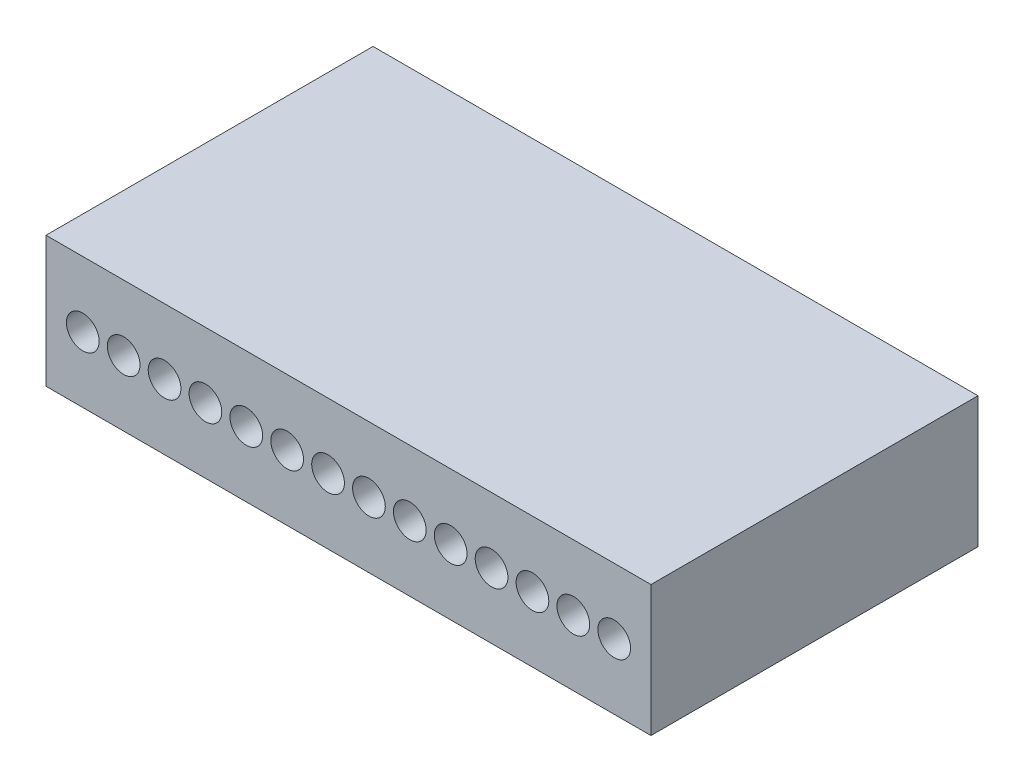
ISO-10303-21;
HEADER;
FILE_DESCRIPTION(('STEP AP214'),'2;1');
FILE_NAME('part.step','',(''),(''),'','','');
FILE_SCHEMA(('AUTOMOTIVE_DESIGN { 1 0 10303 214 1 1 1 1 }'));
ENDSEC;
DATA;
#1=APPLICATION_CONTEXT('core data for automotive mechanical design processes');
#2=APPLICATION_PROTOCOL_DEFINITION('international standard','automotive_design',2000,#1);
#3=PRODUCT_CONTEXT('',#1,'mechanical');
#4=PRODUCT('Part','Part','',(#3));
#5=PRODUCT_RELATED_PRODUCT_CATEGORY('part','',(#4));
#6=PRODUCT_DEFINITION_FORMATION('','',#4);
#7=PRODUCT_DEFINITION_CONTEXT('part definition',#1,'design');
#8=PRODUCT_DEFINITION('design','',#6,#7);
#9=PRODUCT_DEFINITION_SHAPE('','',#8);
#10=(LENGTH_UNIT() NAMED_UNIT(*) SI_UNIT(.MILLI.,.METRE.));
#11=(NAMED_UNIT(*) PLANE_ANGLE_UNIT() SI_UNIT($,.RADIAN.));
#12=(NAMED_UNIT(*) SI_UNIT($,.STERADIAN.) SOLID_ANGLE_UNIT());
#13=UNCERTAINTY_MEASURE_WITH_UNIT(LENGTH_MEASURE(1.E-05),#10,'distance_accuracy_value','');
#14=(GEOMETRIC_REPRESENTATION_CONTEXT(3) GLOBAL_UNCERTAINTY_ASSIGNED_CONTEXT((#13)) GLOBAL_UNIT_ASSIGNED_CONTEXT((#10,
#11,#12)) REPRESENTATION_CONTEXT('',''));
#15=CARTESIAN_POINT('',(0.,0.,0.));
#16=DIRECTION('',(0.,0.,1.));
#17=DIRECTION('',(1.,0.,0.));
#18=AXIS2_PLACEMENT_3D('',#15,#16,#17);
#19=CARTESIAN_POINT('',(0.,0.,10.));
#20=DIRECTION('',(1.,0.,0.));
#21=DIRECTION('',(0.,0.,-1.));
#22=AXIS2_PLACEMENT_3D('',#19,#20,#21);
#23=PLANE('',#22);
#24=DIRECTION('',(0.,-1.,0.));
#25=VECTOR('',#24,1.);
#26=CARTESIAN_POINT('',(0.,0.,0.));
#27=LINE('',#26,#25);
#28=CARTESIAN_POINT('',(0.,4.,0.));
#29=VERTEX_POINT('',#28);
#30=CARTESIAN_POINT('',(0.,0.,0.));
#31=VERTEX_POINT('',#30);
#32=EDGE_CURVE('E99',#29,#31,#27,.T.);
#33=ORIENTED_EDGE('',*,*,#32,.T.);
#34=DIRECTION('',(0.,0.,-1.));
#35=VECTOR('',#34,1.);
#36=CARTESIAN_POINT('',(0.,0.,10.));
#37=LINE('',#36,#35);
#38=CARTESIAN_POINT('',(0.,0.,10.));
#39=VERTEX_POINT('',#38);
#40=EDGE_CURVE('E11',#39,#31,#37,.T.);
#41=ORIENTED_EDGE('',*,*,#40,.F.);
#42=DIRECTION('',(0.,-1.,0.));
#43=VECTOR('',#42,1.);
#44=CARTESIAN_POINT('',(0.,0.,10.));
#45=LINE('',#44,#43);
#46=CARTESIAN_POINT('',(0.,4.,10.));
#47=VERTEX_POINT('',#46);
#48=EDGE_CURVE('E87',#47,#39,#45,.T.);
#49=ORIENTED_EDGE('',*,*,#48,.F.);
#50=DIRECTION('',(0.,0.,-1.));
#51=VECTOR('',#50,1.);
#52=CARTESIAN_POINT('',(0.,4.,10.));
#53=LINE('',#52,#51);
#54=EDGE_CURVE('E95',#47,#29,#53,.T.);
#55=ORIENTED_EDGE('',*,*,#54,.T.);
#56=EDGE_LOOP('',(#33,#41,#49,#55));
#57=FACE_BOUND('',#56,.T.);
#58=ADVANCED_FACE('F36',(#57),#23,.F.);
#59=CARTESIAN_POINT('',(0.,0.,10.));
#60=DIRECTION('',(0.,1.,0.));
#61=DIRECTION('',(0.,0.,1.));
#62=AXIS2_PLACEMENT_3D('',#59,#60,#61);
#63=PLANE('',#62);
#64=DIRECTION('',(1.,0.,0.));
#65=VECTOR('',#64,1.);
#66=CARTESIAN_POINT('',(0.,0.,0.));
#67=LINE('',#66,#65);
#68=CARTESIAN_POINT('',(18.5,0.,0.));
#69=VERTEX_POINT('',#68);
#70=EDGE_CURVE('E91',#31,#69,#67,.T.);
#71=ORIENTED_EDGE('',*,*,#70,.T.);
#72=DIRECTION('',(0.,0.,-1.));
#73=VECTOR('',#72,1.);
#74=CARTESIAN_POINT('',(18.5,0.,10.));
#75=LINE('',#74,#73);
#76=CARTESIAN_POINT('',(18.5,0.,10.));
#77=VERTEX_POINT('',#76);
#78=EDGE_CURVE('E44',#77,#69,#75,.T.);
#79=ORIENTED_EDGE('',*,*,#78,.F.);
#80=DIRECTION('',(1.,0.,0.));
#81=VECTOR('',#80,1.);
#82=CARTESIAN_POINT('',(0.,0.,10.));
#83=LINE('',#82,#81);
#84=EDGE_CURVE('E82',#39,#77,#83,.T.);
#85=ORIENTED_EDGE('',*,*,#84,.F.);
#86=ORIENTED_EDGE('',*,*,#40,.T.);
#87=EDGE_LOOP('',(#71,#79,#85,#86));
#88=FACE_BOUND('',#87,.T.);
#89=ADVANCED_FACE('F90',(#88),#63,.F.);
#90=CARTESIAN_POINT('',(18.5,0.,10.));
#91=DIRECTION('',(-1.,0.,0.));
#92=DIRECTION('',(0.,0.,1.));
#93=AXIS2_PLACEMENT_3D('',#90,#91,#92);
#94=PLANE('',#93);
#95=DIRECTION('',(0.,1.,0.));
#96=VECTOR('',#95,1.);
#97=CARTESIAN_POINT('',(18.5,0.,0.));
#98=LINE('',#97,#96);
#99=CARTESIAN_POINT('',(18.5,4.,0.));
#100=VERTEX_POINT('',#99);
#101=EDGE_CURVE('E69',#69,#100,#98,.T.);
#102=ORIENTED_EDGE('',*,*,#101,.T.);
#103=DIRECTION('',(0.,0.,-1.));
#104=VECTOR('',#103,1.);
#105=CARTESIAN_POINT('',(18.5,4.,10.));
#106=LINE('',#105,#104);
#107=CARTESIAN_POINT('',(18.5,4.,10.));
#108=VERTEX_POINT('',#107);
#109=EDGE_CURVE('E92',#108,#100,#106,.T.);
#110=ORIENTED_EDGE('',*,*,#109,.F.);
#111=DIRECTION('',(0.,1.,0.));
#112=VECTOR('',#111,1.);
#113=CARTESIAN_POINT('',(18.5,0.,10.));
#114=LINE('',#113,#112);
#115=EDGE_CURVE('E85',#77,#108,#114,.T.);
#116=ORIENTED_EDGE('',*,*,#115,.F.);
#117=ORIENTED_EDGE('',*,*,#78,.T.);
#118=EDGE_LOOP('',(#102,#110,#116,#117));
#119=FACE_BOUND('',#118,.T.);
#120=ADVANCED_FACE('F93',(#119),#94,.F.);
#121=CARTESIAN_POINT('',(0.,4.,10.));
#122=DIRECTION('',(0.,-1.,0.));
#123=DIRECTION('',(0.,0.,-1.));
#124=AXIS2_PLACEMENT_3D('',#121,#122,#123);
#125=PLANE('',#124);
#126=DIRECTION('',(-1.,0.,0.));
#127=VECTOR('',#126,1.);
#128=CARTESIAN_POINT('',(0.,4.,0.));
#129=LINE('',#128,#127);
#130=EDGE_CURVE('E75',#100,#29,#129,.T.);
#131=ORIENTED_EDGE('',*,*,#130,.T.);
#132=ORIENTED_EDGE('',*,*,#54,.F.);
#133=DIRECTION('',(-1.,0.,0.));
#134=VECTOR('',#133,1.);
#135=CARTESIAN_POINT('',(0.,4.,10.));
#136=LINE('',#135,#134);
#137=EDGE_CURVE('E52',#108,#47,#136,.T.);
#138=ORIENTED_EDGE('',*,*,#137,.F.);
#139=ORIENTED_EDGE('',*,*,#109,.T.);
#140=EDGE_LOOP('',(#131,#132,#138,#139));
#141=FACE_BOUND('',#140,.T.);
#142=ADVANCED_FACE('F107',(#141),#125,.F.);
#143=CARTESIAN_POINT('',(0.,0.,10.));
#144=DIRECTION('',(0.,0.,-1.));
#145=DIRECTION('',(-1.,0.,0.));
#146=AXIS2_PLACEMENT_3D('',#143,#144,#145);
#147=PLANE('',#146);
#148=CARTESIAN_POINT('',(1.125,2.,10.));
#149=DIRECTION('',(0.,0.,1.));
#150=DIRECTION('',(1.,0.,0.));
#151=AXIS2_PLACEMENT_3D('',#148,#149,#150);
#152=CIRCLE('',#151,0.5);
#153=CARTESIAN_POINT('',(1.625,2.,10.));
#154=VERTEX_POINT('',#153);
#155=EDGE_CURVE('E191',#154,#154,#152,.T.);
#156=ORIENTED_EDGE('',*,*,#155,.F.);
#157=EDGE_LOOP('',(#156));
#158=FACE_BOUND('',#157,.T.);
#159=CARTESIAN_POINT('',(2.375,2.,10.));
#160=DIRECTION('',(0.,0.,1.));
#161=DIRECTION('',(1.,0.,0.));
#162=AXIS2_PLACEMENT_3D('',#159,#160,#161);
#163=CIRCLE('',#162,0.5);
#164=CARTESIAN_POINT('',(2.875,2.,10.));
#165=VERTEX_POINT('',#164);
#166=EDGE_CURVE('E185',#165,#165,#163,.T.);
#167=ORIENTED_EDGE('',*,*,#166,.F.);
#168=EDGE_LOOP('',(#167));
#169=FACE_BOUND('',#168,.T.);
#170=CARTESIAN_POINT('',(3.625,2.,10.));
#171=DIRECTION('',(0.,0.,1.));
#172=DIRECTION('',(1.,0.,0.));
#173=AXIS2_PLACEMENT_3D('',#170,#171,#172);
#174=CIRCLE('',#173,0.5);
#175=CARTESIAN_POINT('',(4.125,2.,10.));
#176=VERTEX_POINT('',#175);
#177=EDGE_CURVE('E179',#176,#176,#174,.T.);
#178=ORIENTED_EDGE('',*,*,#177,.F.);
#179=EDGE_LOOP('',(#178));
#180=FACE_BOUND('',#179,.T.);
#181=CARTESIAN_POINT('',(4.875,2.,10.));
#182=DIRECTION('',(0.,0.,1.));
#183=DIRECTION('',(1.,0.,0.));
#184=AXIS2_PLACEMENT_3D('',#181,#182,#183);
#185=CIRCLE('',#184,0.5);
#186=CARTESIAN_POINT('',(5.375,2.,10.));
#187=VERTEX_POINT('',#186);
#188=EDGE_CURVE('E173',#187,#187,#185,.T.);
#189=ORIENTED_EDGE('',*,*,#188,.F.);
#190=EDGE_LOOP('',(#189));
#191=FACE_BOUND('',#190,.T.);
#192=CARTESIAN_POINT('',(6.125,2.,10.));
#193=DIRECTION('',(0.,0.,1.));
#194=DIRECTION('',(1.,0.,0.));
#195=AXIS2_PLACEMENT_3D('',#192,#193,#194);
#196=CIRCLE('',#195,0.5);
#197=CARTESIAN_POINT('',(6.625,2.,10.));
#198=VERTEX_POINT('',#197);
#199=EDGE_CURVE('E167',#198,#198,#196,.T.);
#200=ORIENTED_EDGE('',*,*,#199,.F.);
#201=EDGE_LOOP('',(#200));
#202=FACE_BOUND('',#201,.T.);
#203=CARTESIAN_POINT('',(7.375,2.,10.));
#204=DIRECTION('',(0.,0.,1.));
#205=DIRECTION('',(1.,0.,0.));
#206=AXIS2_PLACEMENT_3D('',#203,#204,#205);
#207=CIRCLE('',#206,0.500000000000002);
#208=CARTESIAN_POINT('',(7.875,2.,10.));
#209=VERTEX_POINT('',#208);
#210=EDGE_CURVE('E161',#209,#209,#207,.T.);
#211=ORIENTED_EDGE('',*,*,#210,.F.);
#212=EDGE_LOOP('',(#211));
#213=FACE_BOUND('',#212,.T.);
#214=CARTESIAN_POINT('',(8.625,2.,10.));
#215=DIRECTION('',(0.,0.,1.));
#216=DIRECTION('',(1.,0.,0.));
#217=AXIS2_PLACEMENT_3D('',#214,#215,#216);
#218=CIRCLE('',#217,0.499999999999999);
#219=CARTESIAN_POINT('',(9.125,2.,10.));
#220=VERTEX_POINT('',#219);
#221=EDGE_CURVE('E155',#220,#220,#218,.T.);
#222=ORIENTED_EDGE('',*,*,#221,.F.);
#223=EDGE_LOOP('',(#222));
#224=FACE_BOUND('',#223,.T.);
#225=CARTESIAN_POINT('',(9.875,2.,10.));
#226=DIRECTION('',(0.,0.,1.));
#227=DIRECTION('',(1.,0.,0.));
#228=AXIS2_PLACEMENT_3D('',#225,#226,#227);
#229=CIRCLE('',#228,0.499999999999999);
#230=CARTESIAN_POINT('',(10.375,2.,10.));
#231=VERTEX_POINT('',#230);
#232=EDGE_CURVE('E149',#231,#231,#229,.T.);
#233=ORIENTED_EDGE('',*,*,#232,.F.);
#234=EDGE_LOOP('',(#233));
#235=FACE_BOUND('',#234,.T.);
#236=CARTESIAN_POINT('',(11.125,2.,10.));
#237=DIRECTION('',(0.,0.,1.));
#238=DIRECTION('',(1.,0.,0.));
#239=AXIS2_PLACEMENT_3D('',#236,#237,#238);
#240=CIRCLE('',#239,0.499999999999999);
#241=CARTESIAN_POINT('',(11.625,2.,10.));
#242=VERTEX_POINT('',#241);
#243=EDGE_CURVE('E143',#242,#242,#240,.T.);
#244=ORIENTED_EDGE('',*,*,#243,.F.);
#245=EDGE_LOOP('',(#244));
#246=FACE_BOUND('',#245,.T.);
#247=CARTESIAN_POINT('',(12.375,2.,10.));
#248=DIRECTION('',(0.,0.,1.));
#249=DIRECTION('',(1.,0.,0.));
#250=AXIS2_PLACEMENT_3D('',#247,#248,#249);
#251=CIRCLE('',#250,0.499999999999999);
#252=CARTESIAN_POINT('',(12.875,2.,10.));
#253=VERTEX_POINT('',#252);
#254=EDGE_CURVE('E137',#253,#253,#251,.T.);
#255=ORIENTED_EDGE('',*,*,#254,.F.);
#256=EDGE_LOOP('',(#255));
#257=FACE_BOUND('',#256,.T.);
#258=CARTESIAN_POINT('',(13.625,2.,10.));
#259=DIRECTION('',(0.,0.,1.));
#260=DIRECTION('',(1.,0.,0.));
#261=AXIS2_PLACEMENT_3D('',#258,#259,#260);
#262=CIRCLE('',#261,0.499999999999999);
#263=CARTESIAN_POINT('',(14.125,2.,10.));
#264=VERTEX_POINT('',#263);
#265=EDGE_CURVE('E131',#264,#264,#262,.T.);
#266=ORIENTED_EDGE('',*,*,#265,.F.);
#267=EDGE_LOOP('',(#266));
#268=FACE_BOUND('',#267,.T.);
#269=CARTESIAN_POINT('',(14.875,2.,10.));
#270=DIRECTION('',(0.,0.,1.));
#271=DIRECTION('',(1.,0.,0.));
#272=AXIS2_PLACEMENT_3D('',#269,#270,#271);
#273=CIRCLE('',#272,0.499999999999999);
#274=CARTESIAN_POINT('',(15.375,2.,10.));
#275=VERTEX_POINT('',#274);
#276=EDGE_CURVE('E125',#275,#275,#273,.T.);
#277=ORIENTED_EDGE('',*,*,#276,.F.);
#278=EDGE_LOOP('',(#277));
#279=FACE_BOUND('',#278,.T.);
#280=CARTESIAN_POINT('',(16.125,2.,10.));
#281=DIRECTION('',(0.,0.,1.));
#282=DIRECTION('',(1.,0.,0.));
#283=AXIS2_PLACEMENT_3D('',#280,#281,#282);
#284=CIRCLE('',#283,0.499999999999999);
#285=CARTESIAN_POINT('',(16.625,2.,10.));
#286=VERTEX_POINT('',#285);
#287=EDGE_CURVE('E119',#286,#286,#284,.T.);
#288=ORIENTED_EDGE('',*,*,#287,.F.);
#289=EDGE_LOOP('',(#288));
#290=FACE_BOUND('',#289,.T.);
#291=CARTESIAN_POINT('',(17.375,2.,10.));
#292=DIRECTION('',(0.,0.,1.));
#293=DIRECTION('',(1.,0.,0.));
#294=AXIS2_PLACEMENT_3D('',#291,#292,#293);
#295=CIRCLE('',#294,0.499999999999999);
#296=CARTESIAN_POINT('',(17.875,2.,10.));
#297=VERTEX_POINT('',#296);
#298=EDGE_CURVE('E113',#297,#297,#295,.T.);
#299=ORIENTED_EDGE('',*,*,#298,.F.);
#300=EDGE_LOOP('',(#299));
#301=FACE_BOUND('',#300,.T.);
#302=ORIENTED_EDGE('',*,*,#48,.T.);
#303=ORIENTED_EDGE('',*,*,#84,.T.);
#304=ORIENTED_EDGE('',*,*,#115,.T.);
#305=ORIENTED_EDGE('',*,*,#137,.T.);
#306=EDGE_LOOP('',(#302,#303,#304,#305));
#307=FACE_BOUND('',#306,.T.);
#308=ADVANCED_FACE('F83',(#158,#169,#180,#191,#202,#213,#224,#235,#246,#257,#268,#279,#290,#301,
#307),#147,.F.);
#309=CARTESIAN_POINT('',(0.,0.,0.));
#310=DIRECTION('',(0.,0.,-1.));
#311=DIRECTION('',(-1.,0.,0.));
#312=AXIS2_PLACEMENT_3D('',#309,#310,#311);
#313=PLANE('',#312);
#314=ORIENTED_EDGE('',*,*,#32,.F.);
#315=ORIENTED_EDGE('',*,*,#130,.F.);
#316=ORIENTED_EDGE('',*,*,#101,.F.);
#317=ORIENTED_EDGE('',*,*,#70,.F.);
#318=EDGE_LOOP('',(#314,#315,#316,#317));
#319=FACE_BOUND('',#318,.T.);
#320=ADVANCED_FACE('F110',(#319),#313,.T.);
#321=CARTESIAN_POINT('',(17.375,2.,5.));
#322=DIRECTION('',(0.,0.,1.));
#323=DIRECTION('',(1.,0.,0.));
#324=AXIS2_PLACEMENT_3D('',#321,#322,#323);
#325=CYLINDRICAL_SURFACE('',#324,0.499999999999999);
#326=CARTESIAN_POINT('',(17.375,2.,5.));
#327=DIRECTION('',(0.,0.,1.));
#328=DIRECTION('',(1.,0.,0.));
#329=AXIS2_PLACEMENT_3D('',#326,#327,#328);
#330=CIRCLE('',#329,0.499999999999999);
#331=CARTESIAN_POINT('',(17.875,2.,5.));
#332=VERTEX_POINT('',#331);
#333=EDGE_CURVE('E116',#332,#332,#330,.T.);
#334=ORIENTED_EDGE('',*,*,#333,.F.);
#335=EDGE_LOOP('',(#334));
#336=FACE_BOUND('',#335,.T.);
#337=ORIENTED_EDGE('',*,*,#298,.T.);
#338=EDGE_LOOP('',(#337));
#339=FACE_BOUND('',#338,.T.);
#340=ADVANCED_FACE('F235',(#336,#339),#325,.F.);
#341=CARTESIAN_POINT('',(17.375,2.,5.));
#342=DIRECTION('',(0.,0.,1.));
#343=DIRECTION('',(1.,0.,0.));
#344=AXIS2_PLACEMENT_3D('',#341,#342,#343);
#345=PLANE('',#344);
#346=ORIENTED_EDGE('',*,*,#333,.T.);
#347=EDGE_LOOP('',(#346));
#348=FACE_BOUND('',#347,.T.);
#349=ADVANCED_FACE('F237',(#348),#345,.T.);
#350=CARTESIAN_POINT('',(16.125,2.,5.));
#351=DIRECTION('',(0.,0.,1.));
#352=DIRECTION('',(1.,0.,0.));
#353=AXIS2_PLACEMENT_3D('',#350,#351,#352);
#354=CYLINDRICAL_SURFACE('',#353,0.499999999999999);
#355=CARTESIAN_POINT('',(16.125,2.,5.));
#356=DIRECTION('',(0.,0.,1.));
#357=DIRECTION('',(1.,0.,0.));
#358=AXIS2_PLACEMENT_3D('',#355,#356,#357);
#359=CIRCLE('',#358,0.499999999999999);
#360=CARTESIAN_POINT('',(16.625,2.,5.));
#361=VERTEX_POINT('',#360);
#362=EDGE_CURVE('E122',#361,#361,#359,.T.);
#363=ORIENTED_EDGE('',*,*,#362,.F.);
#364=EDGE_LOOP('',(#363));
#365=FACE_BOUND('',#364,.T.);
#366=ORIENTED_EDGE('',*,*,#287,.T.);
#367=EDGE_LOOP('',(#366));
#368=FACE_BOUND('',#367,.T.);
#369=ADVANCED_FACE('F244',(#365,#368),#354,.F.);
#370=CARTESIAN_POINT('',(16.125,2.,5.));
#371=DIRECTION('',(0.,0.,1.));
#372=DIRECTION('',(1.,0.,0.));
#373=AXIS2_PLACEMENT_3D('',#370,#371,#372);
#374=PLANE('',#373);
#375=ORIENTED_EDGE('',*,*,#362,.T.);
#376=EDGE_LOOP('',(#375));
#377=FACE_BOUND('',#376,.T.);
#378=ADVANCED_FACE('F292',(#377),#374,.T.);
#379=CARTESIAN_POINT('',(14.875,2.,5.));
#380=DIRECTION('',(0.,0.,1.));
#381=DIRECTION('',(1.,0.,0.));
#382=AXIS2_PLACEMENT_3D('',#379,#380,#381);
#383=CYLINDRICAL_SURFACE('',#382,0.499999999999999);
#384=CARTESIAN_POINT('',(14.875,2.,5.));
#385=DIRECTION('',(0.,0.,1.));
#386=DIRECTION('',(1.,0.,0.));
#387=AXIS2_PLACEMENT_3D('',#384,#385,#386);
#388=CIRCLE('',#387,0.499999999999999);
#389=CARTESIAN_POINT('',(15.375,2.,5.));
#390=VERTEX_POINT('',#389);
#391=EDGE_CURVE('E128',#390,#390,#388,.T.);
#392=ORIENTED_EDGE('',*,*,#391,.F.);
#393=EDGE_LOOP('',(#392));
#394=FACE_BOUND('',#393,.T.);
#395=ORIENTED_EDGE('',*,*,#276,.T.);
#396=EDGE_LOOP('',(#395));
#397=FACE_BOUND('',#396,.T.);
#398=ADVANCED_FACE('F301',(#394,#397),#383,.F.);
#399=CARTESIAN_POINT('',(14.875,2.,5.));
#400=DIRECTION('',(0.,0.,1.));
#401=DIRECTION('',(1.,0.,0.));
#402=AXIS2_PLACEMENT_3D('',#399,#400,#401);
#403=PLANE('',#402);
#404=ORIENTED_EDGE('',*,*,#391,.T.);
#405=EDGE_LOOP('',(#404));
#406=FACE_BOUND('',#405,.T.);
#407=ADVANCED_FACE('F310',(#406),#403,.T.);
#408=CARTESIAN_POINT('',(13.625,2.,5.));
#409=DIRECTION('',(0.,0.,1.));
#410=DIRECTION('',(1.,0.,0.));
#411=AXIS2_PLACEMENT_3D('',#408,#409,#410);
#412=CYLINDRICAL_SURFACE('',#411,0.499999999999999);
#413=CARTESIAN_POINT('',(13.625,2.,5.));
#414=DIRECTION('',(0.,0.,1.));
#415=DIRECTION('',(1.,0.,0.));
#416=AXIS2_PLACEMENT_3D('',#413,#414,#415);
#417=CIRCLE('',#416,0.499999999999999);
#418=CARTESIAN_POINT('',(14.125,2.,5.));
#419=VERTEX_POINT('',#418);
#420=EDGE_CURVE('E134',#419,#419,#417,.T.);
#421=ORIENTED_EDGE('',*,*,#420,.F.);
#422=EDGE_LOOP('',(#421));
#423=FACE_BOUND('',#422,.T.);
#424=ORIENTED_EDGE('',*,*,#265,.T.);
#425=EDGE_LOOP('',(#424));
#426=FACE_BOUND('',#425,.T.);
#427=ADVANCED_FACE('F319',(#423,#426),#412,.F.);
#428=CARTESIAN_POINT('',(13.625,2.,5.));
#429=DIRECTION('',(0.,0.,1.));
#430=DIRECTION('',(1.,0.,0.));
#431=AXIS2_PLACEMENT_3D('',#428,#429,#430);
#432=PLANE('',#431);
#433=ORIENTED_EDGE('',*,*,#420,.T.);
#434=EDGE_LOOP('',(#433));
#435=FACE_BOUND('',#434,.T.);
#436=ADVANCED_FACE('F328',(#435),#432,.T.);
#437=CARTESIAN_POINT('',(12.375,2.,5.));
#438=DIRECTION('',(0.,0.,1.));
#439=DIRECTION('',(1.,0.,0.));
#440=AXIS2_PLACEMENT_3D('',#437,#438,#439);
#441=CYLINDRICAL_SURFACE('',#440,0.499999999999999);
#442=CARTESIAN_POINT('',(12.375,2.,5.));
#443=DIRECTION('',(0.,0.,1.));
#444=DIRECTION('',(1.,0.,0.));
#445=AXIS2_PLACEMENT_3D('',#442,#443,#444);
#446=CIRCLE('',#445,0.499999999999999);
#447=CARTESIAN_POINT('',(12.875,2.,5.));
#448=VERTEX_POINT('',#447);
#449=EDGE_CURVE('E140',#448,#448,#446,.T.);
#450=ORIENTED_EDGE('',*,*,#449,.F.);
#451=EDGE_LOOP('',(#450));
#452=FACE_BOUND('',#451,.T.);
#453=ORIENTED_EDGE('',*,*,#254,.T.);
#454=EDGE_LOOP('',(#453));
#455=FACE_BOUND('',#454,.T.);
#456=ADVANCED_FACE('F337',(#452,#455),#441,.F.);
#457=CARTESIAN_POINT('',(12.375,2.,5.));
#458=DIRECTION('',(0.,0.,1.));
#459=DIRECTION('',(1.,0.,0.));
#460=AXIS2_PLACEMENT_3D('',#457,#458,#459);
#461=PLANE('',#460);
#462=ORIENTED_EDGE('',*,*,#449,.T.);
#463=EDGE_LOOP('',(#462));
#464=FACE_BOUND('',#463,.T.);
#465=ADVANCED_FACE('F346',(#464),#461,.T.);
#466=CARTESIAN_POINT('',(11.125,2.,5.));
#467=DIRECTION('',(0.,0.,1.));
#468=DIRECTION('',(1.,0.,0.));
#469=AXIS2_PLACEMENT_3D('',#466,#467,#468);
#470=CYLINDRICAL_SURFACE('',#469,0.499999999999999);
#471=CARTESIAN_POINT('',(11.125,2.,5.));
#472=DIRECTION('',(0.,0.,1.));
#473=DIRECTION('',(1.,0.,0.));
#474=AXIS2_PLACEMENT_3D('',#471,#472,#473);
#475=CIRCLE('',#474,0.499999999999999);
#476=CARTESIAN_POINT('',(11.625,2.,5.));
#477=VERTEX_POINT('',#476);
#478=EDGE_CURVE('E146',#477,#477,#475,.T.);
#479=ORIENTED_EDGE('',*,*,#478,.F.);
#480=EDGE_LOOP('',(#479));
#481=FACE_BOUND('',#480,.T.);
#482=ORIENTED_EDGE('',*,*,#243,.T.);
#483=EDGE_LOOP('',(#482));
#484=FACE_BOUND('',#483,.T.);
#485=ADVANCED_FACE('F355',(#481,#484),#470,.F.);
#486=CARTESIAN_POINT('',(11.125,2.,5.));
#487=DIRECTION('',(0.,0.,1.));
#488=DIRECTION('',(1.,0.,0.));
#489=AXIS2_PLACEMENT_3D('',#486,#487,#488);
#490=PLANE('',#489);
#491=ORIENTED_EDGE('',*,*,#478,.T.);
#492=EDGE_LOOP('',(#491));
#493=FACE_BOUND('',#492,.T.);
#494=ADVANCED_FACE('F364',(#493),#490,.T.);
#495=CARTESIAN_POINT('',(9.875,2.,5.));
#496=DIRECTION('',(0.,0.,1.));
#497=DIRECTION('',(1.,0.,0.));
#498=AXIS2_PLACEMENT_3D('',#495,#496,#497);
#499=CYLINDRICAL_SURFACE('',#498,0.499999999999999);
#500=CARTESIAN_POINT('',(9.875,2.,5.));
#501=DIRECTION('',(0.,0.,1.));
#502=DIRECTION('',(1.,0.,0.));
#503=AXIS2_PLACEMENT_3D('',#500,#501,#502);
#504=CIRCLE('',#503,0.499999999999999);
#505=CARTESIAN_POINT('',(10.375,2.,5.));
#506=VERTEX_POINT('',#505);
#507=EDGE_CURVE('E152',#506,#506,#504,.T.);
#508=ORIENTED_EDGE('',*,*,#507,.F.);
#509=EDGE_LOOP('',(#508));
#510=FACE_BOUND('',#509,.T.);
#511=ORIENTED_EDGE('',*,*,#232,.T.);
#512=EDGE_LOOP('',(#511));
#513=FACE_BOUND('',#512,.T.);
#514=ADVANCED_FACE('F373',(#510,#513),#499,.F.);
#515=CARTESIAN_POINT('',(9.875,2.,5.));
#516=DIRECTION('',(0.,0.,1.));
#517=DIRECTION('',(1.,0.,0.));
#518=AXIS2_PLACEMENT_3D('',#515,#516,#517);
#519=PLANE('',#518);
#520=ORIENTED_EDGE('',*,*,#507,.T.);
#521=EDGE_LOOP('',(#520));
#522=FACE_BOUND('',#521,.T.);
#523=ADVANCED_FACE('F382',(#522),#519,.T.);
#524=CARTESIAN_POINT('',(8.625,2.,5.));
#525=DIRECTION('',(0.,0.,1.));
#526=DIRECTION('',(1.,0.,0.));
#527=AXIS2_PLACEMENT_3D('',#524,#525,#526);
#528=CYLINDRICAL_SURFACE('',#527,0.499999999999999);
#529=CARTESIAN_POINT('',(8.625,2.,5.));
#530=DIRECTION('',(0.,0.,1.));
#531=DIRECTION('',(1.,0.,0.));
#532=AXIS2_PLACEMENT_3D('',#529,#530,#531);
#533=CIRCLE('',#532,0.499999999999999);
#534=CARTESIAN_POINT('',(9.125,2.,5.));
#535=VERTEX_POINT('',#534);
#536=EDGE_CURVE('E158',#535,#535,#533,.T.);
#537=ORIENTED_EDGE('',*,*,#536,.F.);
#538=EDGE_LOOP('',(#537));
#539=FACE_BOUND('',#538,.T.);
#540=ORIENTED_EDGE('',*,*,#221,.T.);
#541=EDGE_LOOP('',(#540));
#542=FACE_BOUND('',#541,.T.);
#543=ADVANCED_FACE('F391',(#539,#542),#528,.F.);
#544=CARTESIAN_POINT('',(8.625,2.,5.));
#545=DIRECTION('',(0.,0.,1.));
#546=DIRECTION('',(1.,0.,0.));
#547=AXIS2_PLACEMENT_3D('',#544,#545,#546);
#548=PLANE('',#547);
#549=ORIENTED_EDGE('',*,*,#536,.T.);
#550=EDGE_LOOP('',(#549));
#551=FACE_BOUND('',#550,.T.);
#552=ADVANCED_FACE('F400',(#551),#548,.T.);
#553=CARTESIAN_POINT('',(7.375,2.,5.));
#554=DIRECTION('',(0.,0.,1.));
#555=DIRECTION('',(1.,0.,0.));
#556=AXIS2_PLACEMENT_3D('',#553,#554,#555);
#557=CYLINDRICAL_SURFACE('',#556,0.500000000000002);
#558=CARTESIAN_POINT('',(7.375,2.,5.));
#559=DIRECTION('',(0.,0.,1.));
#560=DIRECTION('',(1.,0.,0.));
#561=AXIS2_PLACEMENT_3D('',#558,#559,#560);
#562=CIRCLE('',#561,0.500000000000002);
#563=CARTESIAN_POINT('',(7.875,2.,5.));
#564=VERTEX_POINT('',#563);
#565=EDGE_CURVE('E164',#564,#564,#562,.T.);
#566=ORIENTED_EDGE('',*,*,#565,.F.);
#567=EDGE_LOOP('',(#566));
#568=FACE_BOUND('',#567,.T.);
#569=ORIENTED_EDGE('',*,*,#210,.T.);
#570=EDGE_LOOP('',(#569));
#571=FACE_BOUND('',#570,.T.);
#572=ADVANCED_FACE('F409',(#568,#571),#557,.F.);
#573=CARTESIAN_POINT('',(7.375,2.,5.));
#574=DIRECTION('',(0.,0.,1.));
#575=DIRECTION('',(1.,0.,0.));
#576=AXIS2_PLACEMENT_3D('',#573,#574,#575);
#577=PLANE('',#576);
#578=ORIENTED_EDGE('',*,*,#565,.T.);
#579=EDGE_LOOP('',(#578));
#580=FACE_BOUND('',#579,.T.);
#581=ADVANCED_FACE('F418',(#580),#577,.T.);
#582=CARTESIAN_POINT('',(6.125,2.,5.));
#583=DIRECTION('',(0.,0.,1.));
#584=DIRECTION('',(1.,0.,0.));
#585=AXIS2_PLACEMENT_3D('',#582,#583,#584);
#586=CYLINDRICAL_SURFACE('',#585,0.5);
#587=CARTESIAN_POINT('',(6.125,2.,5.));
#588=DIRECTION('',(0.,0.,1.));
#589=DIRECTION('',(1.,0.,0.));
#590=AXIS2_PLACEMENT_3D('',#587,#588,#589);
#591=CIRCLE('',#590,0.5);
#592=CARTESIAN_POINT('',(6.625,2.,5.));
#593=VERTEX_POINT('',#592);
#594=EDGE_CURVE('E170',#593,#593,#591,.T.);
#595=ORIENTED_EDGE('',*,*,#594,.F.);
#596=EDGE_LOOP('',(#595));
#597=FACE_BOUND('',#596,.T.);
#598=ORIENTED_EDGE('',*,*,#199,.T.);
#599=EDGE_LOOP('',(#598));
#600=FACE_BOUND('',#599,.T.);
#601=ADVANCED_FACE('F427',(#597,#600),#586,.F.);
#602=CARTESIAN_POINT('',(6.125,2.,5.));
#603=DIRECTION('',(0.,0.,1.));
#604=DIRECTION('',(1.,0.,0.));
#605=AXIS2_PLACEMENT_3D('',#602,#603,#604);
#606=PLANE('',#605);
#607=ORIENTED_EDGE('',*,*,#594,.T.);
#608=EDGE_LOOP('',(#607));
#609=FACE_BOUND('',#608,.T.);
#610=ADVANCED_FACE('F436',(#609),#606,.T.);
#611=CARTESIAN_POINT('',(4.875,2.,5.));
#612=DIRECTION('',(0.,0.,1.));
#613=DIRECTION('',(1.,0.,0.));
#614=AXIS2_PLACEMENT_3D('',#611,#612,#613);
#615=CYLINDRICAL_SURFACE('',#614,0.5);
#616=CARTESIAN_POINT('',(4.875,2.,5.));
#617=DIRECTION('',(0.,0.,1.));
#618=DIRECTION('',(1.,0.,0.));
#619=AXIS2_PLACEMENT_3D('',#616,#617,#618);
#620=CIRCLE('',#619,0.5);
#621=CARTESIAN_POINT('',(5.375,2.,5.));
#622=VERTEX_POINT('',#621);
#623=EDGE_CURVE('E176',#622,#622,#620,.T.);
#624=ORIENTED_EDGE('',*,*,#623,.F.);
#625=EDGE_LOOP('',(#624));
#626=FACE_BOUND('',#625,.T.);
#627=ORIENTED_EDGE('',*,*,#188,.T.);
#628=EDGE_LOOP('',(#627));
#629=FACE_BOUND('',#628,.T.);
#630=ADVANCED_FACE('F445',(#626,#629),#615,.F.);
#631=CARTESIAN_POINT('',(4.875,2.,5.));
#632=DIRECTION('',(0.,0.,1.));
#633=DIRECTION('',(1.,0.,0.));
#634=AXIS2_PLACEMENT_3D('',#631,#632,#633);
#635=PLANE('',#634);
#636=ORIENTED_EDGE('',*,*,#623,.T.);
#637=EDGE_LOOP('',(#636));
#638=FACE_BOUND('',#637,.T.);
#639=ADVANCED_FACE('F454',(#638),#635,.T.);
#640=CARTESIAN_POINT('',(3.625,2.,5.));
#641=DIRECTION('',(0.,0.,1.));
#642=DIRECTION('',(1.,0.,0.));
#643=AXIS2_PLACEMENT_3D('',#640,#641,#642);
#644=CYLINDRICAL_SURFACE('',#643,0.5);
#645=CARTESIAN_POINT('',(3.625,2.,5.));
#646=DIRECTION('',(0.,0.,1.));
#647=DIRECTION('',(1.,0.,0.));
#648=AXIS2_PLACEMENT_3D('',#645,#646,#647);
#649=CIRCLE('',#648,0.5);
#650=CARTESIAN_POINT('',(4.125,2.,5.));
#651=VERTEX_POINT('',#650);
#652=EDGE_CURVE('E182',#651,#651,#649,.T.);
#653=ORIENTED_EDGE('',*,*,#652,.F.);
#654=EDGE_LOOP('',(#653));
#655=FACE_BOUND('',#654,.T.);
#656=ORIENTED_EDGE('',*,*,#177,.T.);
#657=EDGE_LOOP('',(#656));
#658=FACE_BOUND('',#657,.T.);
#659=ADVANCED_FACE('F463',(#655,#658),#644,.F.);
#660=CARTESIAN_POINT('',(3.625,2.,5.));
#661=DIRECTION('',(0.,0.,1.));
#662=DIRECTION('',(1.,0.,0.));
#663=AXIS2_PLACEMENT_3D('',#660,#661,#662);
#664=PLANE('',#663);
#665=ORIENTED_EDGE('',*,*,#652,.T.);
#666=EDGE_LOOP('',(#665));
#667=FACE_BOUND('',#666,.T.);
#668=ADVANCED_FACE('F472',(#667),#664,.T.);
#669=CARTESIAN_POINT('',(2.375,2.,5.));
#670=DIRECTION('',(0.,0.,1.));
#671=DIRECTION('',(1.,0.,0.));
#672=AXIS2_PLACEMENT_3D('',#669,#670,#671);
#673=CYLINDRICAL_SURFACE('',#672,0.5);
#674=CARTESIAN_POINT('',(2.375,2.,5.));
#675=DIRECTION('',(0.,0.,1.));
#676=DIRECTION('',(1.,0.,0.));
#677=AXIS2_PLACEMENT_3D('',#674,#675,#676);
#678=CIRCLE('',#677,0.5);
#679=CARTESIAN_POINT('',(2.875,2.,5.));
#680=VERTEX_POINT('',#679);
#681=EDGE_CURVE('E188',#680,#680,#678,.T.);
#682=ORIENTED_EDGE('',*,*,#681,.F.);
#683=EDGE_LOOP('',(#682));
#684=FACE_BOUND('',#683,.T.);
#685=ORIENTED_EDGE('',*,*,#166,.T.);
#686=EDGE_LOOP('',(#685));
#687=FACE_BOUND('',#686,.T.);
#688=ADVANCED_FACE('F481',(#684,#687),#673,.F.);
#689=CARTESIAN_POINT('',(2.375,2.,5.));
#690=DIRECTION('',(0.,0.,1.));
#691=DIRECTION('',(1.,0.,0.));
#692=AXIS2_PLACEMENT_3D('',#689,#690,#691);
#693=PLANE('',#692);
#694=ORIENTED_EDGE('',*,*,#681,.T.);
#695=EDGE_LOOP('',(#694));
#696=FACE_BOUND('',#695,.T.);
#697=ADVANCED_FACE('F202',(#696),#693,.T.);
#698=CARTESIAN_POINT('',(1.125,2.,5.));
#699=DIRECTION('',(0.,0.,1.));
#700=DIRECTION('',(1.,0.,0.));
#701=AXIS2_PLACEMENT_3D('',#698,#699,#700);
#702=CYLINDRICAL_SURFACE('',#701,0.5);
#703=CARTESIAN_POINT('',(1.125,2.,5.));
#704=DIRECTION('',(0.,0.,1.));
#705=DIRECTION('',(1.,0.,0.));
#706=AXIS2_PLACEMENT_3D('',#703,#704,#705);
#707=CIRCLE('',#706,0.5);
#708=CARTESIAN_POINT('',(1.625,2.,5.));
#709=VERTEX_POINT('',#708);
#710=EDGE_CURVE('E102',#709,#709,#707,.T.);
#711=ORIENTED_EDGE('',*,*,#710,.F.);
#712=EDGE_LOOP('',(#711));
#713=FACE_BOUND('',#712,.T.);
#714=ORIENTED_EDGE('',*,*,#155,.T.);
#715=EDGE_LOOP('',(#714));
#716=FACE_BOUND('',#715,.T.);
#717=ADVANCED_FACE('F199',(#713,#716),#702,.F.);
#718=CARTESIAN_POINT('',(1.125,2.,5.));
#719=DIRECTION('',(0.,0.,1.));
#720=DIRECTION('',(1.,0.,0.));
#721=AXIS2_PLACEMENT_3D('',#718,#719,#720);
#722=PLANE('',#721);
#723=ORIENTED_EDGE('',*,*,#710,.T.);
#724=EDGE_LOOP('',(#723));
#725=FACE_BOUND('',#724,.T.);
#726=ADVANCED_FACE('F197',(#725),#722,.T.);
#727=CLOSED_SHELL('',(#58,#89,#120,#142,#308,#320,#340,#349,#369,#378,#398,#407,#427,#436,#456,
#465,#485,#494,#514,#523,#543,#552,#572,#581,#601,#610,#630,#639,#659,#668,#688,#697,#717,#726));
#728=MANIFOLD_SOLID_BREP('B2',#727);
#729=ADVANCED_BREP_SHAPE_REPRESENTATION('',(#18,#728),#14);
#730=SHAPE_DEFINITION_REPRESENTATION(#9,#729);
ENDSEC;
END-ISO-10303-21;
